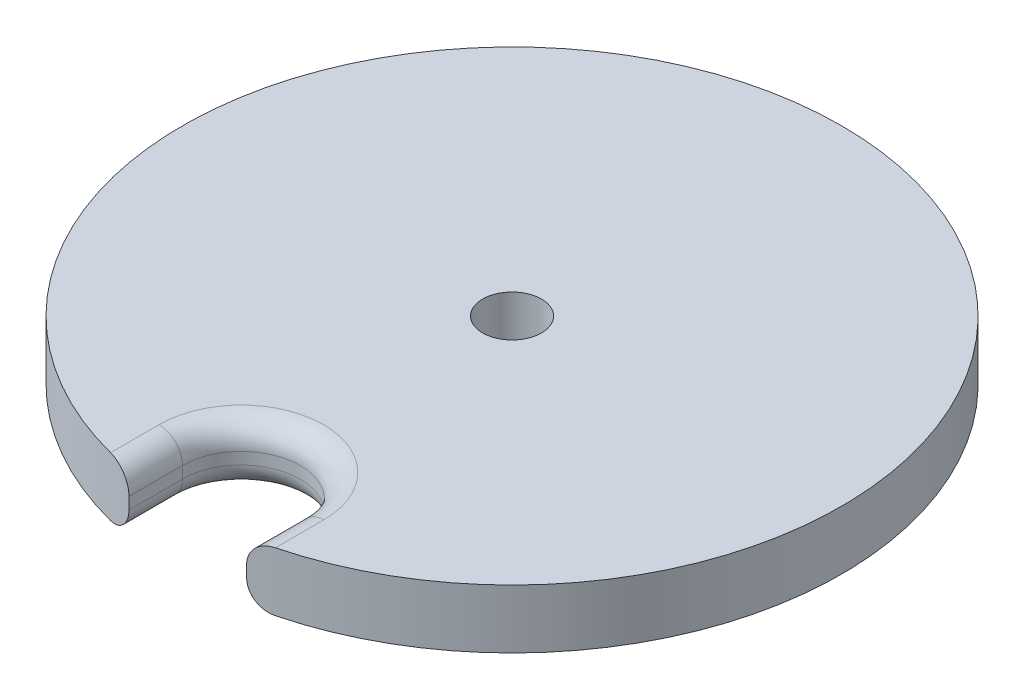
ISO-10303-21;
HEADER;
FILE_DESCRIPTION(('STEP AP214'),'2;1');
FILE_NAME('part.step','',(''),(''),'','','');
FILE_SCHEMA(('AUTOMOTIVE_DESIGN { 1 0 10303 214 1 1 1 1 }'));
ENDSEC;
DATA;
#1=APPLICATION_CONTEXT('core data for automotive mechanical design processes');
#2=APPLICATION_PROTOCOL_DEFINITION('international standard','automotive_design',2000,#1);
#3=PRODUCT_CONTEXT('',#1,'mechanical');
#4=PRODUCT('Part','Part','',(#3));
#5=PRODUCT_RELATED_PRODUCT_CATEGORY('part','',(#4));
#6=PRODUCT_DEFINITION_FORMATION('','',#4);
#7=PRODUCT_DEFINITION_CONTEXT('part definition',#1,'design');
#8=PRODUCT_DEFINITION('design','',#6,#7);
#9=PRODUCT_DEFINITION_SHAPE('','',#8);
#10=(LENGTH_UNIT() NAMED_UNIT(*) SI_UNIT(.MILLI.,.METRE.));
#11=(NAMED_UNIT(*) PLANE_ANGLE_UNIT() SI_UNIT($,.RADIAN.));
#12=(NAMED_UNIT(*) SI_UNIT($,.STERADIAN.) SOLID_ANGLE_UNIT());
#13=UNCERTAINTY_MEASURE_WITH_UNIT(LENGTH_MEASURE(1.E-05),#10,'distance_accuracy_value','');
#14=(GEOMETRIC_REPRESENTATION_CONTEXT(3) GLOBAL_UNCERTAINTY_ASSIGNED_CONTEXT((#13)) GLOBAL_UNIT_ASSIGNED_CONTEXT((#10,
#11,#12)) REPRESENTATION_CONTEXT('',''));
#15=CARTESIAN_POINT('',(0.,0.,0.));
#16=DIRECTION('',(0.,0.,1.));
#17=DIRECTION('',(1.,0.,0.));
#18=AXIS2_PLACEMENT_3D('',#15,#16,#17);
#19=CARTESIAN_POINT('',(0.,6.35,0.));
#20=DIRECTION('',(0.,-1.,0.));
#21=DIRECTION('',(0.,0.,-1.));
#22=AXIS2_PLACEMENT_3D('',#19,#20,#21);
#23=CYLINDRICAL_SURFACE('',#22,35.56);
#24=DIRECTION('',(0.,-1.,0.));
#25=VECTOR('',#24,1.);
#26=CARTESIAN_POINT('',(-6.35,132.323901687016,34.988442377448));
#27=LINE('',#26,#25);
#28=CARTESIAN_POINT('',(-6.35,3.81000000000001,34.988442377448));
#29=VERTEX_POINT('',#28);
#30=CARTESIAN_POINT('',(-6.35,2.53999999999999,34.988442377448));
#31=VERTEX_POINT('',#30);
#32=EDGE_CURVE('E130',#29,#31,#27,.T.);
#33=ORIENTED_EDGE('',*,*,#32,.F.);
#34=CARTESIAN_POINT('',(-6.35,3.81000000000001,34.988442377448));
#35=CARTESIAN_POINT('',(-6.34999258277697,3.8805050421445,34.9884421275792));
#36=CARTESIAN_POINT('',(-6.35293555121313,3.95100664895525,34.9879095671128));
#37=CARTESIAN_POINT('',(-6.36466510283629,4.0915011775261,34.9857785850231));
#38=CARTESIAN_POINT('',(-6.37345128664168,4.16149413372178,34.984180236246));
#39=CARTESIAN_POINT('',(-6.39679738912225,4.30040352933138,34.9799187629901));
#40=CARTESIAN_POINT('',(-6.41135100037991,4.36932105956533,34.9772568016812));
#41=CARTESIAN_POINT('',(-6.44610337670917,4.50564690426291,34.9708687410591));
#42=CARTESIAN_POINT('',(-6.46630209278693,4.57305523181942,34.9671426509815));
#43=CARTESIAN_POINT('',(-6.53517786772271,4.77235426724794,34.9543597549374));
#44=CARTESIAN_POINT('',(-6.59214653774694,4.90138980045867,34.9436961901922));
#45=CARTESIAN_POINT('',(-6.72634467132318,5.14787743535318,34.9181116301039));
#46=CARTESIAN_POINT('',(-6.80357228782923,5.26533059168138,34.9031910228724));
#47=CARTESIAN_POINT('',(-6.97638772508356,5.48613559564788,34.8690606394191));
#48=CARTESIAN_POINT('',(-7.0720669033306,5.58941270742685,34.8498294402847));
#49=CARTESIAN_POINT('',(-7.27863532380823,5.77842890975529,34.8072717453194));
#50=CARTESIAN_POINT('',(-7.38952703324843,5.86416514984778,34.7839445850222));
#51=CARTESIAN_POINT('',(-7.62502891853146,6.01714026970114,34.7330857914091));
#52=CARTESIAN_POINT('',(-7.74982323353251,6.08407564984983,34.7054952209117));
#53=CARTESIAN_POINT('',(-8.00808008497715,6.19613089215097,34.6468146401208));
#54=CARTESIAN_POINT('',(-8.14154159678282,6.24125332772824,34.6157250431655));
#55=CARTESIAN_POINT('',(-8.37790176671861,6.29999819018857,34.5591527322376));
#56=CARTESIAN_POINT('',(-8.47971328966636,6.31876271161591,34.534317006082));
#57=CARTESIAN_POINT('',(-8.68438369537742,6.3437627905384,34.4834211069405));
#58=CARTESIAN_POINT('',(-8.7872405962132,6.35001875859917,34.4573629997899));
#59=CARTESIAN_POINT('',(-8.89,6.35000000000001,34.4308219477839));
#60=B_SPLINE_CURVE_WITH_KNOTS('',3,(#34,#35,#36,#37,#38,#39,#40,#41,#42,#43,#44,#45,#46,#47,#48,
#49,#50,#51,#52,#53,#54,#55,#56,#57,#58,#59),.UNSPECIFIED.,.F.,.F.,(4,2,2,2,2,2,2,2,2,2,2,2,4),
(0.,0.211445581821278,0.422876712900286,0.634077252373424,0.845275958895048,1.26746065175673,
1.68960686662164,2.11389952089377,2.53826106963292,2.96912378809337,3.39993566226874,
3.71860924484102,4.03676241283442),.UNSPECIFIED.);
#61=CARTESIAN_POINT('',(-8.89,6.35,34.4308219477839));
#62=VERTEX_POINT('',#61);
#63=EDGE_CURVE('E143',#29,#62,#60,.T.);
#64=ORIENTED_EDGE('',*,*,#63,.T.);
#65=CARTESIAN_POINT('',(0.,6.35,0.));
#66=DIRECTION('',(0.,1.,0.));
#67=DIRECTION('',(0.,0.,1.));
#68=AXIS2_PLACEMENT_3D('',#65,#66,#67);
#69=CIRCLE('',#68,35.56);
#70=CARTESIAN_POINT('',(8.89,6.35,34.4308219477839));
#71=VERTEX_POINT('',#70);
#72=EDGE_CURVE('E148',#71,#62,#69,.T.);
#73=ORIENTED_EDGE('',*,*,#72,.F.);
#74=CARTESIAN_POINT('',(8.89,6.35,34.4308219477839));
#75=CARTESIAN_POINT('',(8.8177895358685,6.34999835958435,34.4494678983368));
#76=CARTESIAN_POINT('',(8.74555168475556,6.34691864073061,34.467875711243));
#77=CARTESIAN_POINT('',(8.60145309118368,6.33459448650982,34.5041173388478));
#78=CARTESIAN_POINT('',(8.52959238053005,6.32534953937152,34.5219511057662));
#79=CARTESIAN_POINT('',(8.31532397694218,6.28836893912935,34.5744200422547));
#80=CARTESIAN_POINT('',(8.17414608861228,6.25138754031829,34.6080444860391));
#81=CARTESIAN_POINT('',(7.89940994954924,6.15342688542503,34.6717880515722));
#82=CARTESIAN_POINT('',(7.76586046409137,6.09242063485757,34.7019031807338));
#83=CARTESIAN_POINT('',(7.51067097688565,5.94787858621619,34.758027623098));
#84=CARTESIAN_POINT('',(7.38902413410122,5.86435583439279,34.784039300084));
#85=CARTESIAN_POINT('',(7.16380600067568,5.67888046696495,34.8311137848005));
#86=CARTESIAN_POINT('',(7.05992108233071,5.5773311366444,34.8522653947));
#87=CARTESIAN_POINT('',(6.87061667139868,5.357490187544,34.8900783994576));
#88=CARTESIAN_POINT('',(6.78520066254553,5.23919541707401,34.9067389473265));
#89=CARTESIAN_POINT('',(6.63731597697629,4.9920778787465,34.9351571381094));
#90=CARTESIAN_POINT('',(6.57438670379805,4.86354160524709,34.9470139503311));
#91=CARTESIAN_POINT('',(6.47095184020467,4.59748554173238,34.9663148377588));
#92=CARTESIAN_POINT('',(6.43042754928471,4.45997335106438,34.973762593389));
#93=CARTESIAN_POINT('',(6.38453857325651,4.23616766148808,34.9821606292525));
#94=CARTESIAN_POINT('',(6.37159310334866,4.15140651625295,34.9845184219455));
#95=CARTESIAN_POINT('',(6.35432667632231,3.98110995258996,34.9876572331938));
#96=CARTESIAN_POINT('',(6.34999282949458,3.89557588413654,34.9884406083268));
#97=CARTESIAN_POINT('',(6.35,3.81000000000001,34.988442377448));
#98=B_SPLINE_CURVE_WITH_KNOTS('',3,(#74,#75,#76,#77,#78,#79,#80,#81,#82,#83,#84,#85,#86,#87,#88,
#89,#90,#91,#92,#93,#94,#95,#96,#97),.UNSPECIFIED.,.F.,.F.,(4,2,2,2,2,2,2,2,2,2,2,4),(0.,
0.223605698629952,0.447229960921766,0.894221721302601,1.34171716422644,1.78895387972326,
2.22721959424791,2.66556790551501,3.09433883591402,3.52275134672353,3.7796686545225,
4.03620112297398),.UNSPECIFIED.);
#99=CARTESIAN_POINT('',(6.35,3.81000000000001,34.988442377448));
#100=VERTEX_POINT('',#99);
#101=EDGE_CURVE('E177',#71,#100,#98,.T.);
#102=ORIENTED_EDGE('',*,*,#101,.T.);
#103=DIRECTION('',(0.,-1.,0.));
#104=VECTOR('',#103,1.);
#105=CARTESIAN_POINT('',(6.35,132.323901687016,34.988442377448));
#106=LINE('',#105,#104);
#107=CARTESIAN_POINT('',(6.35,2.53999999999999,34.988442377448));
#108=VERTEX_POINT('',#107);
#109=EDGE_CURVE('E131',#100,#108,#106,.T.);
#110=ORIENTED_EDGE('',*,*,#109,.T.);
#111=CARTESIAN_POINT('',(6.35,2.54,34.988442377448));
#112=CARTESIAN_POINT('',(6.34999258277697,2.4694949578555,34.9884421275792));
#113=CARTESIAN_POINT('',(6.35293555121313,2.39899335104476,34.9879095671128));
#114=CARTESIAN_POINT('',(6.36466510283629,2.25849882247391,34.9857785850231));
#115=CARTESIAN_POINT('',(6.37345128664168,2.18850586627823,34.984180236246));
#116=CARTESIAN_POINT('',(6.39679738912225,2.04959647066863,34.9799187629901));
#117=CARTESIAN_POINT('',(6.41135100037992,1.98067894043468,34.9772568016812));
#118=CARTESIAN_POINT('',(6.44610337670917,1.8443530957371,34.9708687410591));
#119=CARTESIAN_POINT('',(6.46630209278693,1.77694476818059,34.9671426509815));
#120=CARTESIAN_POINT('',(6.53517786772271,1.57764573275207,34.9543597549374));
#121=CARTESIAN_POINT('',(6.59214653774695,1.44861019954134,34.9436961901922));
#122=CARTESIAN_POINT('',(6.72634467132318,1.20212256464682,34.9181116301039));
#123=CARTESIAN_POINT('',(6.80357228782923,1.08466940831862,34.9031910228724));
#124=CARTESIAN_POINT('',(6.97638772508356,0.863864404352126,34.8690606394191));
#125=CARTESIAN_POINT('',(7.0720669033306,0.760587292573154,34.8498294402847));
#126=CARTESIAN_POINT('',(7.27863532380823,0.571571090244716,34.8072717453194));
#127=CARTESIAN_POINT('',(7.38952703324843,0.485834850152231,34.7839445850222));
#128=CARTESIAN_POINT('',(7.62502891853146,0.332859730298863,34.7330857914091));
#129=CARTESIAN_POINT('',(7.74982323353252,0.26592435015018,34.7054952209117));
#130=CARTESIAN_POINT('',(8.00808008497716,0.153869107849034,34.6468146401208));
#131=CARTESIAN_POINT('',(8.14154159678282,0.108746672271763,34.6157250431655));
#132=CARTESIAN_POINT('',(8.37790176671861,0.0500018098114396,34.5591527322376));
#133=CARTESIAN_POINT('',(8.47971328966637,0.0312372883840995,34.534317006082));
#134=CARTESIAN_POINT('',(8.68438369537742,0.00623720946161247,34.4834211069405));
#135=CARTESIAN_POINT('',(8.7872405962132,-1.87585991655543E-05,34.4573629997899));
#136=CARTESIAN_POINT('',(8.89,0.,34.4308219477839));
#137=B_SPLINE_CURVE_WITH_KNOTS('',3,(#111,#112,#113,#114,#115,#116,#117,#118,#119,#120,#121,
#122,#123,#124,#125,#126,#127,#128,#129,#130,#131,#132,#133,#134,#135,#136),.UNSPECIFIED.,.F.,
.F.,(4,2,2,2,2,2,2,2,2,2,2,2,4),(0.,0.211445581821278,0.422876712900286,0.634077252373424,
0.845275958895048,1.26746065175674,1.68960686662164,2.11389952089377,2.53826106963292,
2.96912378809337,3.39993566226874,3.71860924484102,4.03676241283442),.UNSPECIFIED.);
#138=CARTESIAN_POINT('',(8.89,0.,34.4308219477839));
#139=VERTEX_POINT('',#138);
#140=EDGE_CURVE('E144',#108,#139,#137,.T.);
#141=ORIENTED_EDGE('',*,*,#140,.T.);
#142=CARTESIAN_POINT('',(0.,0.,0.));
#143=DIRECTION('',(0.,1.,0.));
#144=DIRECTION('',(0.,0.,1.));
#145=AXIS2_PLACEMENT_3D('',#142,#143,#144);
#146=CIRCLE('',#145,35.56);
#147=CARTESIAN_POINT('',(-8.89,0.,34.4308219477839));
#148=VERTEX_POINT('',#147);
#149=EDGE_CURVE('E230',#139,#148,#146,.T.);
#150=ORIENTED_EDGE('',*,*,#149,.T.);
#151=CARTESIAN_POINT('',(-8.89,0.,34.4308219477839));
#152=CARTESIAN_POINT('',(-8.8177895358685,1.64041565680778E-06,34.4494678983367));
#153=CARTESIAN_POINT('',(-8.74555168475556,0.00308135926939639,34.467875711243));
#154=CARTESIAN_POINT('',(-8.60145309118368,0.0154055134901906,34.5041173388477));
#155=CARTESIAN_POINT('',(-8.52959238053005,0.0246504606284892,34.5219511057662));
#156=CARTESIAN_POINT('',(-8.31532397694218,0.0616310608706526,34.5744200422547));
#157=CARTESIAN_POINT('',(-8.17414608861228,0.0986124596817214,34.6080444860391));
#158=CARTESIAN_POINT('',(-7.89940994954924,0.196573114574977,34.6717880515722));
#159=CARTESIAN_POINT('',(-7.76586046409137,0.257579365142437,34.7019031807338));
#160=CARTESIAN_POINT('',(-7.51067097688565,0.402121413783812,34.758027623098));
#161=CARTESIAN_POINT('',(-7.38902413410122,0.485644165607214,34.784039300084));
#162=CARTESIAN_POINT('',(-7.16380600067568,0.671119533035061,34.8311137848005));
#163=CARTESIAN_POINT('',(-7.05992108233071,0.772668863355608,34.8522653947));
#164=CARTESIAN_POINT('',(-6.87061667139868,0.992509812456006,34.8900783994576));
#165=CARTESIAN_POINT('',(-6.78520066254553,1.11080458292599,34.9067389473265));
#166=CARTESIAN_POINT('',(-6.63731597697629,1.35792212125351,34.9351571381094));
#167=CARTESIAN_POINT('',(-6.57438670379805,1.48645839475291,34.9470139503311));
#168=CARTESIAN_POINT('',(-6.47095184020467,1.75251445826763,34.9663148377587));
#169=CARTESIAN_POINT('',(-6.43042754928471,1.89002664893563,34.973762593389));
#170=CARTESIAN_POINT('',(-6.38453857325651,2.11383233851193,34.9821606292525));
#171=CARTESIAN_POINT('',(-6.37159310334866,2.19859348374706,34.9845184219455));
#172=CARTESIAN_POINT('',(-6.35432667632231,2.36889004741004,34.9876572331939));
#173=CARTESIAN_POINT('',(-6.34999282949458,2.45442411586347,34.9884406083268));
#174=CARTESIAN_POINT('',(-6.35,2.54,34.988442377448));
#175=B_SPLINE_CURVE_WITH_KNOTS('',3,(#151,#152,#153,#154,#155,#156,#157,#158,#159,#160,#161,
#162,#163,#164,#165,#166,#167,#168,#169,#170,#171,#172,#173,#174),.UNSPECIFIED.,.F.,.F.,(4,2,2,
2,2,2,2,2,2,2,2,4),(0.,0.223605698629949,0.447229960921763,0.8942217213026,1.34171716422643,
1.78895387972326,2.22721959424791,2.66556790551501,3.09433883591402,3.52275134672353,
3.7796686545225,4.03620112297398),.UNSPECIFIED.);
#176=EDGE_CURVE('E146',#148,#31,#175,.T.);
#177=ORIENTED_EDGE('',*,*,#176,.T.);
#178=EDGE_LOOP('',(#33,#64,#73,#102,#110,#141,#150,#177));
#179=FACE_BOUND('',#178,.T.);
#180=ADVANCED_FACE('F39',(#179),#23,.T.);
#181=CARTESIAN_POINT('',(0.,6.35,0.));
#182=DIRECTION('',(0.,1.,0.));
#183=DIRECTION('',(0.,0.,1.));
#184=AXIS2_PLACEMENT_3D('',#181,#182,#183);
#185=PLANE('',#184);
#186=CARTESIAN_POINT('',(0.,6.35000000000001,0.));
#187=DIRECTION('',(0.,-1.,0.));
#188=DIRECTION('',(0.,0.,-1.));
#189=AXIS2_PLACEMENT_3D('',#186,#187,#188);
#190=CIRCLE('',#189,3.175);
#191=CARTESIAN_POINT('',(0.,6.35000000000001,-3.175));
#192=VERTEX_POINT('',#191);
#193=EDGE_CURVE('E209',#192,#192,#190,.T.);
#194=ORIENTED_EDGE('',*,*,#193,.T.);
#195=EDGE_LOOP('',(#194));
#196=FACE_BOUND('',#195,.T.);
#197=ORIENTED_EDGE('',*,*,#72,.T.);
#198=DIRECTION('',(0.,0.,1.));
#199=VECTOR('',#198,1.);
#200=CARTESIAN_POINT('',(-8.89,6.35,29.21));
#201=LINE('',#200,#199);
#202=CARTESIAN_POINT('',(-8.89,6.35,29.21));
#203=VERTEX_POINT('',#202);
#204=EDGE_CURVE('E222',#62,#203,#201,.F.);
#205=ORIENTED_EDGE('',*,*,#204,.T.);
#206=CARTESIAN_POINT('',(0.,6.35,29.21));
#207=DIRECTION('',(0.,1.,0.));
#208=DIRECTION('',(0.,0.,1.));
#209=AXIS2_PLACEMENT_3D('',#206,#207,#208);
#210=CIRCLE('',#209,8.89);
#211=CARTESIAN_POINT('',(8.89,6.35,29.21));
#212=VERTEX_POINT('',#211);
#213=EDGE_CURVE('E137',#203,#212,#210,.F.);
#214=ORIENTED_EDGE('',*,*,#213,.T.);
#215=DIRECTION('',(0.,0.,-1.));
#216=VECTOR('',#215,1.);
#217=CARTESIAN_POINT('',(8.89,6.35,34.988442377448));
#218=LINE('',#217,#216);
#219=EDGE_CURVE('E224',#212,#71,#218,.F.);
#220=ORIENTED_EDGE('',*,*,#219,.T.);
#221=EDGE_LOOP('',(#197,#205,#214,#220));
#222=FACE_BOUND('',#221,.T.);
#223=ADVANCED_FACE('F167',(#196,#222),#185,.T.);
#224=CARTESIAN_POINT('',(0.,0.,0.));
#225=DIRECTION('',(0.,1.,0.));
#226=DIRECTION('',(0.,0.,1.));
#227=AXIS2_PLACEMENT_3D('',#224,#225,#226);
#228=PLANE('',#227);
#229=CARTESIAN_POINT('',(0.,0.,0.));
#230=DIRECTION('',(0.,-1.,0.));
#231=DIRECTION('',(0.,0.,-1.));
#232=AXIS2_PLACEMENT_3D('',#229,#230,#231);
#233=CIRCLE('',#232,3.175);
#234=CARTESIAN_POINT('',(0.,0.,-3.175));
#235=VERTEX_POINT('',#234);
#236=EDGE_CURVE('E212',#235,#235,#233,.T.);
#237=ORIENTED_EDGE('',*,*,#236,.F.);
#238=EDGE_LOOP('',(#237));
#239=FACE_BOUND('',#238,.T.);
#240=CARTESIAN_POINT('',(0.,0.,29.21));
#241=DIRECTION('',(0.,1.,0.));
#242=DIRECTION('',(0.,0.,1.));
#243=AXIS2_PLACEMENT_3D('',#240,#241,#242);
#244=CIRCLE('',#243,8.89);
#245=CARTESIAN_POINT('',(8.89,0.,29.21));
#246=VERTEX_POINT('',#245);
#247=CARTESIAN_POINT('',(-8.89,0.,29.21));
#248=VERTEX_POINT('',#247);
#249=EDGE_CURVE('E49',#246,#248,#244,.T.);
#250=ORIENTED_EDGE('',*,*,#249,.T.);
#251=DIRECTION('',(0.,0.,1.));
#252=VECTOR('',#251,1.);
#253=CARTESIAN_POINT('',(-8.89000000000001,0.,0.));
#254=LINE('',#253,#252);
#255=EDGE_CURVE('E11',#248,#148,#254,.T.);
#256=ORIENTED_EDGE('',*,*,#255,.T.);
#257=ORIENTED_EDGE('',*,*,#149,.F.);
#258=DIRECTION('',(0.,0.,-1.));
#259=VECTOR('',#258,1.);
#260=CARTESIAN_POINT('',(8.89,0.,0.));
#261=LINE('',#260,#259);
#262=EDGE_CURVE('E60',#139,#246,#261,.T.);
#263=ORIENTED_EDGE('',*,*,#262,.T.);
#264=EDGE_LOOP('',(#250,#256,#257,#263));
#265=FACE_BOUND('',#264,.T.);
#266=ADVANCED_FACE('F169',(#239,#265),#228,.F.);
#267=CARTESIAN_POINT('',(-6.35,132.323901687016,29.21));
#268=DIRECTION('',(-1.,0.,0.));
#269=DIRECTION('',(0.,0.,1.));
#270=AXIS2_PLACEMENT_3D('',#267,#268,#269);
#271=PLANE('',#270);
#272=DIRECTION('',(0.,-1.,0.));
#273=VECTOR('',#272,1.);
#274=CARTESIAN_POINT('',(-6.35,132.323901687016,29.21));
#275=LINE('',#274,#273);
#276=CARTESIAN_POINT('',(-6.35,3.81000000000001,29.21));
#277=VERTEX_POINT('',#276);
#278=CARTESIAN_POINT('',(-6.35,2.53999999999999,29.21));
#279=VERTEX_POINT('',#278);
#280=EDGE_CURVE('E110',#277,#279,#275,.T.);
#281=ORIENTED_EDGE('',*,*,#280,.F.);
#282=DIRECTION('',(0.,0.,1.));
#283=VECTOR('',#282,1.);
#284=CARTESIAN_POINT('',(-6.35,3.81000000000001,34.988442377448));
#285=LINE('',#284,#283);
#286=EDGE_CURVE('E126',#277,#29,#285,.T.);
#287=ORIENTED_EDGE('',*,*,#286,.T.);
#288=ORIENTED_EDGE('',*,*,#32,.T.);
#289=DIRECTION('',(0.,0.,1.));
#290=VECTOR('',#289,1.);
#291=CARTESIAN_POINT('',(-6.35,2.53999999999999,29.21));
#292=LINE('',#291,#290);
#293=EDGE_CURVE('E129',#31,#279,#292,.F.);
#294=ORIENTED_EDGE('',*,*,#293,.T.);
#295=EDGE_LOOP('',(#281,#287,#288,#294));
#296=FACE_BOUND('',#295,.T.);
#297=ADVANCED_FACE('F123',(#296),#271,.F.);
#298=CARTESIAN_POINT('',(0.,132.323901687016,29.21));
#299=DIRECTION('',(0.,-1.,0.));
#300=DIRECTION('',(0.,0.,-1.));
#301=AXIS2_PLACEMENT_3D('',#298,#299,#300);
#302=CYLINDRICAL_SURFACE('',#301,6.35);
#303=DIRECTION('',(0.,-1.,0.));
#304=VECTOR('',#303,1.);
#305=CARTESIAN_POINT('',(6.35,132.323901687016,29.21));
#306=LINE('',#305,#304);
#307=CARTESIAN_POINT('',(6.35,3.81000000000001,29.21));
#308=VERTEX_POINT('',#307);
#309=CARTESIAN_POINT('',(6.35,2.53999999999999,29.21));
#310=VERTEX_POINT('',#309);
#311=EDGE_CURVE('E113',#308,#310,#306,.T.);
#312=ORIENTED_EDGE('',*,*,#311,.F.);
#313=CARTESIAN_POINT('',(0.,3.81000000000001,29.21));
#314=DIRECTION('',(0.,1.,0.));
#315=DIRECTION('',(0.,0.,1.));
#316=AXIS2_PLACEMENT_3D('',#313,#314,#315);
#317=CIRCLE('',#316,6.35);
#318=EDGE_CURVE('E107',#308,#277,#317,.T.);
#319=ORIENTED_EDGE('',*,*,#318,.T.);
#320=ORIENTED_EDGE('',*,*,#280,.T.);
#321=CARTESIAN_POINT('',(0.,2.53999999999999,29.21));
#322=DIRECTION('',(0.,1.,0.));
#323=DIRECTION('',(0.,0.,1.));
#324=AXIS2_PLACEMENT_3D('',#321,#322,#323);
#325=CIRCLE('',#324,6.35);
#326=EDGE_CURVE('E119',#279,#310,#325,.F.);
#327=ORIENTED_EDGE('',*,*,#326,.T.);
#328=EDGE_LOOP('',(#312,#319,#320,#327));
#329=FACE_BOUND('',#328,.T.);
#330=ADVANCED_FACE('F109',(#329),#302,.F.);
#331=CARTESIAN_POINT('',(6.35,132.323901687016,29.21));
#332=DIRECTION('',(1.,0.,0.));
#333=DIRECTION('',(0.,0.,-1.));
#334=AXIS2_PLACEMENT_3D('',#331,#332,#333);
#335=PLANE('',#334);
#336=ORIENTED_EDGE('',*,*,#109,.F.);
#337=DIRECTION('',(0.,0.,-1.));
#338=VECTOR('',#337,1.);
#339=CARTESIAN_POINT('',(6.35,3.81000000000001,29.21));
#340=LINE('',#339,#338);
#341=EDGE_CURVE('E218',#100,#308,#340,.T.);
#342=ORIENTED_EDGE('',*,*,#341,.T.);
#343=ORIENTED_EDGE('',*,*,#311,.T.);
#344=DIRECTION('',(0.,0.,-1.));
#345=VECTOR('',#344,1.);
#346=CARTESIAN_POINT('',(6.35,2.53999999999999,29.21));
#347=LINE('',#346,#345);
#348=EDGE_CURVE('E118',#310,#108,#347,.F.);
#349=ORIENTED_EDGE('',*,*,#348,.T.);
#350=EDGE_LOOP('',(#336,#342,#343,#349));
#351=FACE_BOUND('',#350,.T.);
#352=ADVANCED_FACE('F191',(#351),#335,.F.);
#353=CARTESIAN_POINT('',(8.89,3.81000000000001,29.21));
#354=DIRECTION('',(0.,0.,1.));
#355=DIRECTION('',(1.,0.,0.));
#356=AXIS2_PLACEMENT_3D('',#353,#354,#355);
#357=CYLINDRICAL_SURFACE('',#356,2.54);
#358=ORIENTED_EDGE('',*,*,#101,.F.);
#359=ORIENTED_EDGE('',*,*,#219,.F.);
#360=CARTESIAN_POINT('',(8.89,3.81000000000001,29.21));
#361=DIRECTION('',(0.,0.,-1.));
#362=DIRECTION('',(-1.,0.,0.));
#363=AXIS2_PLACEMENT_3D('',#360,#361,#362);
#364=CIRCLE('',#363,2.54);
#365=EDGE_CURVE('E140',#308,#212,#364,.T.);
#366=ORIENTED_EDGE('',*,*,#365,.F.);
#367=ORIENTED_EDGE('',*,*,#341,.F.);
#368=EDGE_LOOP('',(#358,#359,#366,#367));
#369=FACE_BOUND('',#368,.T.);
#370=ADVANCED_FACE('F188',(#369),#357,.T.);
#371=CARTESIAN_POINT('',(0.,3.81000000000001,29.21));
#372=DIRECTION('',(0.,1.,0.));
#373=DIRECTION('',(0.,0.,1.));
#374=AXIS2_PLACEMENT_3D('',#371,#372,#373);
#375=TOROIDAL_SURFACE('',#374,8.89,2.54);
#376=ORIENTED_EDGE('',*,*,#365,.T.);
#377=ORIENTED_EDGE('',*,*,#213,.F.);
#378=CARTESIAN_POINT('',(-8.89,3.81000000000001,29.21));
#379=DIRECTION('',(0.,0.,1.));
#380=DIRECTION('',(1.,0.,0.));
#381=AXIS2_PLACEMENT_3D('',#378,#379,#380);
#382=CIRCLE('',#381,2.54);
#383=EDGE_CURVE('E135',#277,#203,#382,.T.);
#384=ORIENTED_EDGE('',*,*,#383,.F.);
#385=ORIENTED_EDGE('',*,*,#318,.F.);
#386=EDGE_LOOP('',(#376,#377,#384,#385));
#387=FACE_BOUND('',#386,.T.);
#388=ADVANCED_FACE('F136',(#387),#375,.T.);
#389=CARTESIAN_POINT('',(-8.89,3.81000000000001,29.21));
#390=DIRECTION('',(0.,0.,-1.));
#391=DIRECTION('',(-1.,0.,0.));
#392=AXIS2_PLACEMENT_3D('',#389,#390,#391);
#393=CYLINDRICAL_SURFACE('',#392,2.54);
#394=ORIENTED_EDGE('',*,*,#383,.T.);
#395=ORIENTED_EDGE('',*,*,#204,.F.);
#396=ORIENTED_EDGE('',*,*,#63,.F.);
#397=ORIENTED_EDGE('',*,*,#286,.F.);
#398=EDGE_LOOP('',(#394,#395,#396,#397));
#399=FACE_BOUND('',#398,.T.);
#400=ADVANCED_FACE('F142',(#399),#393,.T.);
#401=CARTESIAN_POINT('',(8.89,2.54,0.));
#402=DIRECTION('',(0.,0.,-1.));
#403=DIRECTION('',(-1.,0.,0.));
#404=AXIS2_PLACEMENT_3D('',#401,#402,#403);
#405=CYLINDRICAL_SURFACE('',#404,2.54);
#406=ORIENTED_EDGE('',*,*,#140,.F.);
#407=ORIENTED_EDGE('',*,*,#348,.F.);
#408=CARTESIAN_POINT('',(8.89,2.54,29.21));
#409=DIRECTION('',(0.,0.,-1.));
#410=DIRECTION('',(-1.,0.,0.));
#411=AXIS2_PLACEMENT_3D('',#408,#409,#410);
#412=CIRCLE('',#411,2.54);
#413=EDGE_CURVE('E44',#246,#310,#412,.T.);
#414=ORIENTED_EDGE('',*,*,#413,.F.);
#415=ORIENTED_EDGE('',*,*,#262,.F.);
#416=EDGE_LOOP('',(#406,#407,#414,#415));
#417=FACE_BOUND('',#416,.T.);
#418=ADVANCED_FACE('F41',(#417),#405,.T.);
#419=CARTESIAN_POINT('',(0.,2.53999999999999,29.21));
#420=DIRECTION('',(0.,1.,0.));
#421=DIRECTION('',(0.,0.,1.));
#422=AXIS2_PLACEMENT_3D('',#419,#420,#421);
#423=TOROIDAL_SURFACE('',#422,8.89,2.54);
#424=ORIENTED_EDGE('',*,*,#413,.T.);
#425=ORIENTED_EDGE('',*,*,#326,.F.);
#426=CARTESIAN_POINT('',(-8.89,2.54,29.21));
#427=DIRECTION('',(0.,0.,1.));
#428=DIRECTION('',(1.,0.,0.));
#429=AXIS2_PLACEMENT_3D('',#426,#427,#428);
#430=CIRCLE('',#429,2.54);
#431=EDGE_CURVE('E208',#248,#279,#430,.T.);
#432=ORIENTED_EDGE('',*,*,#431,.F.);
#433=ORIENTED_EDGE('',*,*,#249,.F.);
#434=EDGE_LOOP('',(#424,#425,#432,#433));
#435=FACE_BOUND('',#434,.T.);
#436=ADVANCED_FACE('F197',(#435),#423,.T.);
#437=CARTESIAN_POINT('',(-8.89000000000001,2.54,0.));
#438=DIRECTION('',(0.,0.,1.));
#439=DIRECTION('',(1.,0.,0.));
#440=AXIS2_PLACEMENT_3D('',#437,#438,#439);
#441=CYLINDRICAL_SURFACE('',#440,2.54);
#442=ORIENTED_EDGE('',*,*,#431,.T.);
#443=ORIENTED_EDGE('',*,*,#293,.F.);
#444=ORIENTED_EDGE('',*,*,#176,.F.);
#445=ORIENTED_EDGE('',*,*,#255,.F.);
#446=EDGE_LOOP('',(#442,#443,#444,#445));
#447=FACE_BOUND('',#446,.T.);
#448=ADVANCED_FACE('F193',(#447),#441,.T.);
#449=CARTESIAN_POINT('',(0.,6.35000000000001,0.));
#450=DIRECTION('',(0.,-1.,0.));
#451=DIRECTION('',(0.,0.,-1.));
#452=AXIS2_PLACEMENT_3D('',#449,#450,#451);
#453=CYLINDRICAL_SURFACE('',#452,3.175);
#454=ORIENTED_EDGE('',*,*,#193,.F.);
#455=EDGE_LOOP('',(#454));
#456=FACE_BOUND('',#455,.T.);
#457=ORIENTED_EDGE('',*,*,#236,.T.);
#458=EDGE_LOOP('',(#457));
#459=FACE_BOUND('',#458,.T.);
#460=ADVANCED_FACE('F196',(#456,#459),#453,.F.);
#461=CLOSED_SHELL('',(#180,#223,#266,#297,#330,#352,#370,#388,#400,#418,#436,#448,#460));
#462=MANIFOLD_SOLID_BREP('B2',#461);
#463=ADVANCED_BREP_SHAPE_REPRESENTATION('',(#18,#462),#14);
#464=SHAPE_DEFINITION_REPRESENTATION(#9,#463);
ENDSEC;
END-ISO-10303-21;
